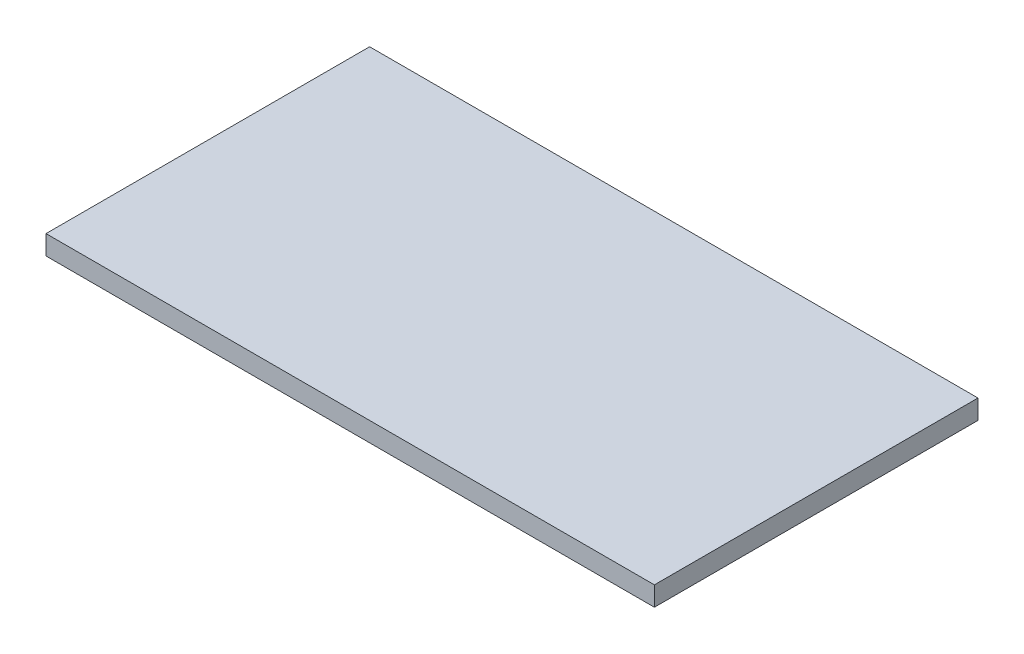
ISO-10303-21;
HEADER;
FILE_DESCRIPTION(('STEP AP214'),'2;1');
FILE_NAME('part.step','',(''),(''),'','','');
FILE_SCHEMA(('AUTOMOTIVE_DESIGN { 1 0 10303 214 1 1 1 1 }'));
ENDSEC;
DATA;
#1=APPLICATION_CONTEXT('core data for automotive mechanical design processes');
#2=APPLICATION_PROTOCOL_DEFINITION('international standard','automotive_design',2000,#1);
#3=PRODUCT_CONTEXT('',#1,'mechanical');
#4=PRODUCT('Part','Part','',(#3));
#5=PRODUCT_RELATED_PRODUCT_CATEGORY('part','',(#4));
#6=PRODUCT_DEFINITION_FORMATION('','',#4);
#7=PRODUCT_DEFINITION_CONTEXT('part definition',#1,'design');
#8=PRODUCT_DEFINITION('design','',#6,#7);
#9=PRODUCT_DEFINITION_SHAPE('','',#8);
#10=(LENGTH_UNIT() NAMED_UNIT(*) SI_UNIT(.MILLI.,.METRE.));
#11=(NAMED_UNIT(*) PLANE_ANGLE_UNIT() SI_UNIT($,.RADIAN.));
#12=(NAMED_UNIT(*) SI_UNIT($,.STERADIAN.) SOLID_ANGLE_UNIT());
#13=UNCERTAINTY_MEASURE_WITH_UNIT(LENGTH_MEASURE(1.E-05),#10,'distance_accuracy_value','');
#14=(GEOMETRIC_REPRESENTATION_CONTEXT(3) GLOBAL_UNCERTAINTY_ASSIGNED_CONTEXT((#13)) GLOBAL_UNIT_ASSIGNED_CONTEXT((#10,
#11,#12)) REPRESENTATION_CONTEXT('',''));
#15=CARTESIAN_POINT('',(0.,0.,0.));
#16=DIRECTION('',(0.,0.,1.));
#17=DIRECTION('',(1.,0.,0.));
#18=AXIS2_PLACEMENT_3D('',#15,#16,#17);
#19=CARTESIAN_POINT('',(-282.,18.,150.));
#20=DIRECTION('',(1.,0.,0.));
#21=DIRECTION('',(0.,0.,-1.));
#22=AXIS2_PLACEMENT_3D('',#19,#20,#21);
#23=PLANE('',#22);
#24=DIRECTION('',(0.,0.,1.));
#25=VECTOR('',#24,1.);
#26=CARTESIAN_POINT('',(-282.,0.,150.));
#27=LINE('',#26,#25);
#28=CARTESIAN_POINT('',(-282.,0.,-150.));
#29=VERTEX_POINT('',#28);
#30=CARTESIAN_POINT('',(-282.,0.,150.));
#31=VERTEX_POINT('',#30);
#32=EDGE_CURVE('E96',#29,#31,#27,.T.);
#33=ORIENTED_EDGE('',*,*,#32,.T.);
#34=DIRECTION('',(0.,-1.,0.));
#35=VECTOR('',#34,1.);
#36=CARTESIAN_POINT('',(-282.,18.,150.));
#37=LINE('',#36,#35);
#38=CARTESIAN_POINT('',(-282.,18.,150.));
#39=VERTEX_POINT('',#38);
#40=EDGE_CURVE('E11',#39,#31,#37,.T.);
#41=ORIENTED_EDGE('',*,*,#40,.F.);
#42=DIRECTION('',(0.,0.,1.));
#43=VECTOR('',#42,1.);
#44=CARTESIAN_POINT('',(-282.,18.,150.));
#45=LINE('',#44,#43);
#46=CARTESIAN_POINT('',(-282.,18.,-150.));
#47=VERTEX_POINT('',#46);
#48=EDGE_CURVE('E84',#47,#39,#45,.T.);
#49=ORIENTED_EDGE('',*,*,#48,.F.);
#50=DIRECTION('',(0.,-1.,0.));
#51=VECTOR('',#50,1.);
#52=CARTESIAN_POINT('',(-282.,18.,-150.));
#53=LINE('',#52,#51);
#54=EDGE_CURVE('E92',#47,#29,#53,.T.);
#55=ORIENTED_EDGE('',*,*,#54,.T.);
#56=EDGE_LOOP('',(#33,#41,#49,#55));
#57=FACE_BOUND('',#56,.T.);
#58=ADVANCED_FACE('F33',(#57),#23,.F.);
#59=CARTESIAN_POINT('',(282.,18.,150.));
#60=DIRECTION('',(0.,0.,-1.));
#61=DIRECTION('',(-1.,0.,0.));
#62=AXIS2_PLACEMENT_3D('',#59,#60,#61);
#63=PLANE('',#62);
#64=DIRECTION('',(1.,0.,0.));
#65=VECTOR('',#64,1.);
#66=CARTESIAN_POINT('',(282.,0.,150.));
#67=LINE('',#66,#65);
#68=CARTESIAN_POINT('',(282.,0.,150.));
#69=VERTEX_POINT('',#68);
#70=EDGE_CURVE('E88',#31,#69,#67,.T.);
#71=ORIENTED_EDGE('',*,*,#70,.T.);
#72=DIRECTION('',(0.,-1.,0.));
#73=VECTOR('',#72,1.);
#74=CARTESIAN_POINT('',(282.,18.,150.));
#75=LINE('',#74,#73);
#76=CARTESIAN_POINT('',(282.,18.,150.));
#77=VERTEX_POINT('',#76);
#78=EDGE_CURVE('E41',#77,#69,#75,.T.);
#79=ORIENTED_EDGE('',*,*,#78,.F.);
#80=DIRECTION('',(1.,0.,0.));
#81=VECTOR('',#80,1.);
#82=CARTESIAN_POINT('',(282.,18.,150.));
#83=LINE('',#82,#81);
#84=EDGE_CURVE('E79',#39,#77,#83,.T.);
#85=ORIENTED_EDGE('',*,*,#84,.F.);
#86=ORIENTED_EDGE('',*,*,#40,.T.);
#87=EDGE_LOOP('',(#71,#79,#85,#86));
#88=FACE_BOUND('',#87,.T.);
#89=ADVANCED_FACE('F87',(#88),#63,.F.);
#90=CARTESIAN_POINT('',(282.,18.,150.));
#91=DIRECTION('',(-1.,0.,0.));
#92=DIRECTION('',(0.,0.,1.));
#93=AXIS2_PLACEMENT_3D('',#90,#91,#92);
#94=PLANE('',#93);
#95=DIRECTION('',(0.,0.,-1.));
#96=VECTOR('',#95,1.);
#97=CARTESIAN_POINT('',(282.,0.,150.));
#98=LINE('',#97,#96);
#99=CARTESIAN_POINT('',(282.,0.,-150.));
#100=VERTEX_POINT('',#99);
#101=EDGE_CURVE('E66',#69,#100,#98,.T.);
#102=ORIENTED_EDGE('',*,*,#101,.T.);
#103=DIRECTION('',(0.,-1.,0.));
#104=VECTOR('',#103,1.);
#105=CARTESIAN_POINT('',(282.,18.,-150.));
#106=LINE('',#105,#104);
#107=CARTESIAN_POINT('',(282.,18.,-150.));
#108=VERTEX_POINT('',#107);
#109=EDGE_CURVE('E89',#108,#100,#106,.T.);
#110=ORIENTED_EDGE('',*,*,#109,.F.);
#111=DIRECTION('',(0.,0.,-1.));
#112=VECTOR('',#111,1.);
#113=CARTESIAN_POINT('',(282.,18.,150.));
#114=LINE('',#113,#112);
#115=EDGE_CURVE('E82',#77,#108,#114,.T.);
#116=ORIENTED_EDGE('',*,*,#115,.F.);
#117=ORIENTED_EDGE('',*,*,#78,.T.);
#118=EDGE_LOOP('',(#102,#110,#116,#117));
#119=FACE_BOUND('',#118,.T.);
#120=ADVANCED_FACE('F90',(#119),#94,.F.);
#121=CARTESIAN_POINT('',(282.,18.,-150.));
#122=DIRECTION('',(0.,0.,1.));
#123=DIRECTION('',(1.,0.,0.));
#124=AXIS2_PLACEMENT_3D('',#121,#122,#123);
#125=PLANE('',#124);
#126=DIRECTION('',(-1.,0.,0.));
#127=VECTOR('',#126,1.);
#128=CARTESIAN_POINT('',(282.,0.,-150.));
#129=LINE('',#128,#127);
#130=EDGE_CURVE('E72',#100,#29,#129,.T.);
#131=ORIENTED_EDGE('',*,*,#130,.T.);
#132=ORIENTED_EDGE('',*,*,#54,.F.);
#133=DIRECTION('',(-1.,0.,0.));
#134=VECTOR('',#133,1.);
#135=CARTESIAN_POINT('',(282.,18.,-150.));
#136=LINE('',#135,#134);
#137=EDGE_CURVE('E49',#108,#47,#136,.T.);
#138=ORIENTED_EDGE('',*,*,#137,.F.);
#139=ORIENTED_EDGE('',*,*,#109,.T.);
#140=EDGE_LOOP('',(#131,#132,#138,#139));
#141=FACE_BOUND('',#140,.T.);
#142=ADVANCED_FACE('F103',(#141),#125,.F.);
#143=CARTESIAN_POINT('',(0.,18.,0.));
#144=DIRECTION('',(0.,1.,0.));
#145=DIRECTION('',(0.,0.,1.));
#146=AXIS2_PLACEMENT_3D('',#143,#144,#145);
#147=PLANE('',#146);
#148=ORIENTED_EDGE('',*,*,#48,.T.);
#149=ORIENTED_EDGE('',*,*,#84,.T.);
#150=ORIENTED_EDGE('',*,*,#115,.T.);
#151=ORIENTED_EDGE('',*,*,#137,.T.);
#152=EDGE_LOOP('',(#148,#149,#150,#151));
#153=FACE_BOUND('',#152,.T.);
#154=ADVANCED_FACE('F80',(#153),#147,.T.);
#155=CARTESIAN_POINT('',(0.,0.,0.));
#156=DIRECTION('',(0.,1.,0.));
#157=DIRECTION('',(0.,0.,1.));
#158=AXIS2_PLACEMENT_3D('',#155,#156,#157);
#159=PLANE('',#158);
#160=ORIENTED_EDGE('',*,*,#32,.F.);
#161=ORIENTED_EDGE('',*,*,#130,.F.);
#162=ORIENTED_EDGE('',*,*,#101,.F.);
#163=ORIENTED_EDGE('',*,*,#70,.F.);
#164=EDGE_LOOP('',(#160,#161,#162,#163));
#165=FACE_BOUND('',#164,.T.);
#166=ADVANCED_FACE('F106',(#165),#159,.F.);
#167=CLOSED_SHELL('',(#58,#89,#120,#142,#154,#166));
#168=MANIFOLD_SOLID_BREP('B2',#167);
#169=ADVANCED_BREP_SHAPE_REPRESENTATION('',(#18,#168),#14);
#170=SHAPE_DEFINITION_REPRESENTATION(#9,#169);
ENDSEC;
END-ISO-10303-21;
